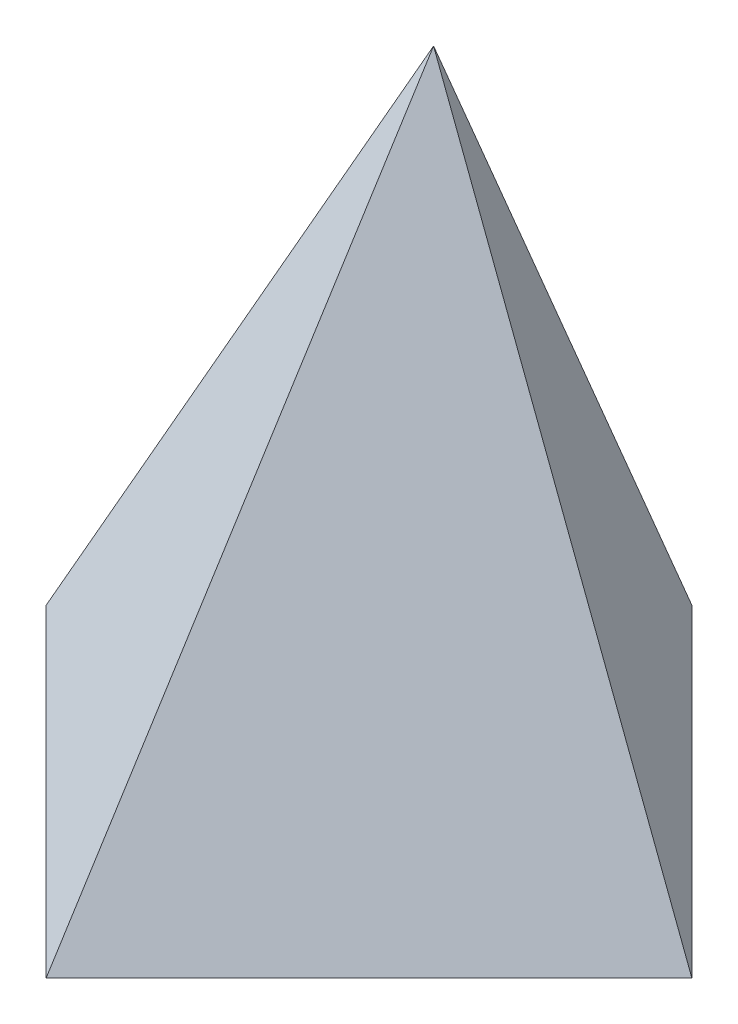
ISO-10303-21;
HEADER;
FILE_DESCRIPTION(('STEP AP214'),'2;1');
FILE_NAME('part.step','',(''),(''),'','','');
FILE_SCHEMA(('AUTOMOTIVE_DESIGN { 1 0 10303 214 1 1 1 1 }'));
ENDSEC;
DATA;
#1=APPLICATION_CONTEXT('core data for automotive mechanical design processes');
#2=APPLICATION_PROTOCOL_DEFINITION('international standard','automotive_design',2000,#1);
#3=PRODUCT_CONTEXT('',#1,'mechanical');
#4=PRODUCT('Part','Part','',(#3));
#5=PRODUCT_RELATED_PRODUCT_CATEGORY('part','',(#4));
#6=PRODUCT_DEFINITION_FORMATION('','',#4);
#7=PRODUCT_DEFINITION_CONTEXT('part definition',#1,'design');
#8=PRODUCT_DEFINITION('design','',#6,#7);
#9=PRODUCT_DEFINITION_SHAPE('','',#8);
#10=(LENGTH_UNIT() NAMED_UNIT(*) SI_UNIT(.MILLI.,.METRE.));
#11=(NAMED_UNIT(*) PLANE_ANGLE_UNIT() SI_UNIT($,.RADIAN.));
#12=(NAMED_UNIT(*) SI_UNIT($,.STERADIAN.) SOLID_ANGLE_UNIT());
#13=UNCERTAINTY_MEASURE_WITH_UNIT(LENGTH_MEASURE(1.E-05),#10,'distance_accuracy_value','');
#14=(GEOMETRIC_REPRESENTATION_CONTEXT(3) GLOBAL_UNCERTAINTY_ASSIGNED_CONTEXT((#13)) GLOBAL_UNIT_ASSIGNED_CONTEXT((#10,
#11,#12)) REPRESENTATION_CONTEXT('',''));
#15=CARTESIAN_POINT('',(0.,0.,0.));
#16=DIRECTION('',(0.,0.,1.));
#17=DIRECTION('',(1.,0.,0.));
#18=AXIS2_PLACEMENT_3D('',#15,#16,#17);
#19=CARTESIAN_POINT('',(46.2962962962963,18.5185185185185,-46.2962962962963));
#20=DIRECTION('',(-0.680413817439772,-0.272165526975909,0.680413817439772));
#21=DIRECTION('',(0.707106781186547,0.,0.707106781186548));
#22=AXIS2_PLACEMENT_3D('',#19,#20,#21);
#23=PLANE('',#22);
#24=DIRECTION('',(0.409938766806849,-0.910975037348554,0.0455487518674276));
#25=VECTOR('',#24,1.);
#26=CARTESIAN_POINT('',(83.195020746888,37.344398340249,-1.86721991701244));
#27=LINE('',#26,#25);
#28=CARTESIAN_POINT('',(10.,200.,-10.));
#29=VERTEX_POINT('',#28);
#30=CARTESIAN_POINT('',(100.,0.,0.));
#31=VERTEX_POINT('',#30);
#32=EDGE_CURVE('E37',#29,#31,#27,.T.);
#33=ORIENTED_EDGE('',*,*,#32,.T.);
#34=DIRECTION('',(-0.707106781186547,0.,-0.707106781186547));
#35=VECTOR('',#34,1.);
#36=CARTESIAN_POINT('',(100.,0.,0.));
#37=LINE('',#36,#35);
#38=CARTESIAN_POINT('',(0.,0.,-100.));
#39=VERTEX_POINT('',#38);
#40=EDGE_CURVE('E11',#31,#39,#37,.T.);
#41=ORIENTED_EDGE('',*,*,#40,.T.);
#42=DIRECTION('',(0.0455487518674275,0.910975037348554,0.409938766806849));
#43=VECTOR('',#42,1.);
#44=CARTESIAN_POINT('',(1.86721991701246,37.344398340249,-83.195020746888));
#45=LINE('',#44,#43);
#46=EDGE_CURVE('E42',#39,#29,#45,.T.);
#47=ORIENTED_EDGE('',*,*,#46,.T.);
#48=EDGE_LOOP('',(#33,#41,#47));
#49=FACE_BOUND('',#48,.T.);
#50=ADVANCED_FACE('F34',(#49),#23,.F.);
#51=CARTESIAN_POINT('',(44.4444444444444,22.2222222222222,44.4444444444445));
#52=DIRECTION('',(0.666666666666667,0.333333333333333,0.666666666666667));
#53=DIRECTION('',(0.707106781186548,0.,-0.707106781186547));
#54=AXIS2_PLACEMENT_3D('',#51,#52,#53);
#55=PLANE('',#54);
#56=ORIENTED_EDGE('',*,*,#32,.F.);
#57=DIRECTION('',(0.043768810953241,0.875376219064817,-0.481456920485649));
#58=VECTOR('',#57,1.);
#59=CARTESIAN_POINT('',(2.10727969348657,42.1455938697318,76.8199233716475));
#60=LINE('',#59,#58);
#61=CARTESIAN_POINT('',(0.,0.,100.));
#62=VERTEX_POINT('',#61);
#63=EDGE_CURVE('E69',#62,#29,#60,.T.);
#64=ORIENTED_EDGE('',*,*,#63,.F.);
#65=DIRECTION('',(0.707106781186547,0.,-0.707106781186547));
#66=VECTOR('',#65,1.);
#67=CARTESIAN_POINT('',(0.,0.,100.));
#68=LINE('',#67,#66);
#69=EDGE_CURVE('E76',#62,#31,#68,.T.);
#70=ORIENTED_EDGE('',*,*,#69,.T.);
#71=EDGE_LOOP('',(#56,#64,#70));
#72=FACE_BOUND('',#71,.T.);
#73=ADVANCED_FACE('F75',(#72),#55,.T.);
#74=CARTESIAN_POINT('',(-42.3728813559322,25.4237288135593,42.3728813559322));
#75=DIRECTION('',(-0.650944554904119,0.390566732942472,0.650944554904119));
#76=DIRECTION('',(0.707106781186548,0.,0.707106781186548));
#77=AXIS2_PLACEMENT_3D('',#74,#75,#76);
#78=PLANE('',#77);
#79=DIRECTION('',(0.707106781186547,0.,0.707106781186547));
#80=VECTOR('',#79,1.);
#81=CARTESIAN_POINT('',(-100.,0.,0.));
#82=LINE('',#81,#80);
#83=CARTESIAN_POINT('',(-100.,0.,0.));
#84=VERTEX_POINT('',#83);
#85=EDGE_CURVE('E66',#84,#62,#82,.T.);
#86=ORIENTED_EDGE('',*,*,#85,.T.);
#87=ORIENTED_EDGE('',*,*,#63,.T.);
#88=DIRECTION('',(0.481456920485649,0.875376219064817,-0.043768810953241));
#89=VECTOR('',#88,1.);
#90=CARTESIAN_POINT('',(-76.8199233716475,42.1455938697318,-2.10727969348657));
#91=LINE('',#90,#89);
#92=EDGE_CURVE('E71',#84,#29,#91,.T.);
#93=ORIENTED_EDGE('',*,*,#92,.F.);
#94=EDGE_LOOP('',(#86,#87,#93));
#95=FACE_BOUND('',#94,.T.);
#96=ADVANCED_FACE('F68',(#95),#78,.T.);
#97=CARTESIAN_POINT('',(-44.4444444444445,22.2222222222222,-44.4444444444444));
#98=DIRECTION('',(-0.666666666666667,0.333333333333333,-0.666666666666667));
#99=DIRECTION('',(-0.707106781186547,0.,0.707106781186548));
#100=AXIS2_PLACEMENT_3D('',#97,#98,#99);
#101=PLANE('',#100);
#102=ORIENTED_EDGE('',*,*,#46,.F.);
#103=DIRECTION('',(-0.707106781186547,0.,0.707106781186547));
#104=VECTOR('',#103,1.);
#105=CARTESIAN_POINT('',(0.,0.,-100.));
#106=LINE('',#105,#104);
#107=EDGE_CURVE('E77',#39,#84,#106,.T.);
#108=ORIENTED_EDGE('',*,*,#107,.T.);
#109=ORIENTED_EDGE('',*,*,#92,.T.);
#110=EDGE_LOOP('',(#102,#108,#109));
#111=FACE_BOUND('',#110,.T.);
#112=ADVANCED_FACE('F84',(#111),#101,.T.);
#113=CARTESIAN_POINT('',(0.,0.,0.));
#114=DIRECTION('',(0.,1.,0.));
#115=DIRECTION('',(0.,0.,1.));
#116=AXIS2_PLACEMENT_3D('',#113,#114,#115);
#117=PLANE('',#116);
#118=ORIENTED_EDGE('',*,*,#40,.F.);
#119=ORIENTED_EDGE('',*,*,#69,.F.);
#120=ORIENTED_EDGE('',*,*,#85,.F.);
#121=ORIENTED_EDGE('',*,*,#107,.F.);
#122=EDGE_LOOP('',(#118,#119,#120,#121));
#123=FACE_BOUND('',#122,.T.);
#124=ADVANCED_FACE('F79',(#123),#117,.F.);
#125=CLOSED_SHELL('',(#50,#73,#96,#112,#124));
#126=MANIFOLD_SOLID_BREP('B2',#125);
#127=ADVANCED_BREP_SHAPE_REPRESENTATION('',(#18,#126),#14);
#128=SHAPE_DEFINITION_REPRESENTATION(#9,#127);
ENDSEC;
END-ISO-10303-21;
